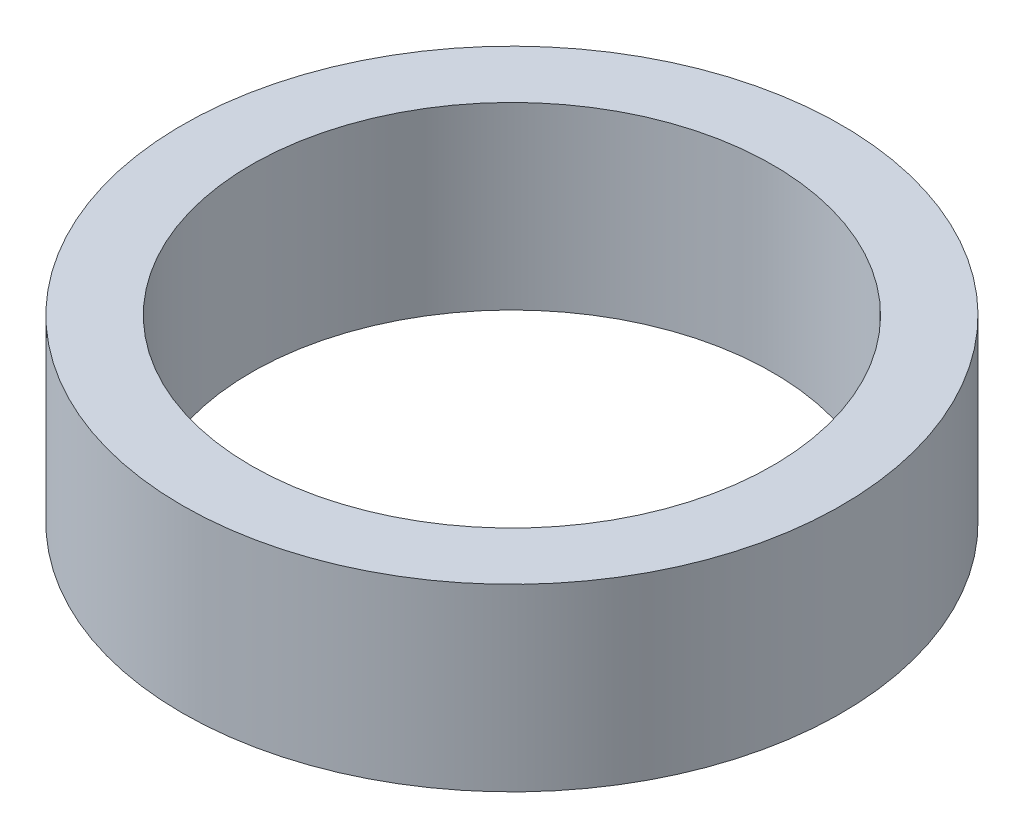
ISO-10303-21;
HEADER;
FILE_DESCRIPTION(('STEP AP214'),'2;1');
FILE_NAME('part.step','',(''),(''),'','','');
FILE_SCHEMA(('AUTOMOTIVE_DESIGN { 1 0 10303 214 1 1 1 1 }'));
ENDSEC;
DATA;
#1=APPLICATION_CONTEXT('core data for automotive mechanical design processes');
#2=APPLICATION_PROTOCOL_DEFINITION('international standard','automotive_design',2000,#1);
#3=PRODUCT_CONTEXT('',#1,'mechanical');
#4=PRODUCT('Part','Part','',(#3));
#5=PRODUCT_RELATED_PRODUCT_CATEGORY('part','',(#4));
#6=PRODUCT_DEFINITION_FORMATION('','',#4);
#7=PRODUCT_DEFINITION_CONTEXT('part definition',#1,'design');
#8=PRODUCT_DEFINITION('design','',#6,#7);
#9=PRODUCT_DEFINITION_SHAPE('','',#8);
#10=(LENGTH_UNIT() NAMED_UNIT(*) SI_UNIT(.MILLI.,.METRE.));
#11=(NAMED_UNIT(*) PLANE_ANGLE_UNIT() SI_UNIT($,.RADIAN.));
#12=(NAMED_UNIT(*) SI_UNIT($,.STERADIAN.) SOLID_ANGLE_UNIT());
#13=UNCERTAINTY_MEASURE_WITH_UNIT(LENGTH_MEASURE(1.E-05),#10,'distance_accuracy_value','');
#14=(GEOMETRIC_REPRESENTATION_CONTEXT(3) GLOBAL_UNCERTAINTY_ASSIGNED_CONTEXT((#13)) GLOBAL_UNIT_ASSIGNED_CONTEXT((#10,
#11,#12)) REPRESENTATION_CONTEXT('',''));
#15=CARTESIAN_POINT('',(0.,0.,0.));
#16=DIRECTION('',(0.,0.,1.));
#17=DIRECTION('',(1.,0.,0.));
#18=AXIS2_PLACEMENT_3D('',#15,#16,#17);
#19=CARTESIAN_POINT('',(-10.0999386023771,3.,-4.89887794912905));
#20=DIRECTION('',(0.,1.,0.));
#21=DIRECTION('',(0.,0.,1.));
#22=AXIS2_PLACEMENT_3D('',#19,#20,#21);
#23=PLANE('',#22);
#24=CARTESIAN_POINT('',(-10.0999386023771,3.,-4.89887794912905));
#25=DIRECTION('',(0.,1.,0.));
#26=DIRECTION('',(0.,0.,1.));
#27=AXIS2_PLACEMENT_3D('',#24,#25,#26);
#28=CIRCLE('',#27,5.5);
#29=CARTESIAN_POINT('',(-10.0999386023771,3.,0.601122050870947));
#30=VERTEX_POINT('',#29);
#31=EDGE_CURVE('E10',#30,#30,#28,.T.);
#32=ORIENTED_EDGE('',*,*,#31,.T.);
#33=EDGE_LOOP('',(#32));
#34=FACE_BOUND('',#33,.T.);
#35=CARTESIAN_POINT('',(-10.0999386023771,3.,-4.89887794912905));
#36=DIRECTION('',(0.,1.,0.));
#37=DIRECTION('',(0.,0.,1.));
#38=AXIS2_PLACEMENT_3D('',#35,#36,#37);
#39=CIRCLE('',#38,4.35);
#40=CARTESIAN_POINT('',(-10.0999386023771,3.,-0.548877949129053));
#41=VERTEX_POINT('',#40);
#42=EDGE_CURVE('E50',#41,#41,#39,.T.);
#43=ORIENTED_EDGE('',*,*,#42,.F.);
#44=EDGE_LOOP('',(#43));
#45=FACE_BOUND('',#44,.T.);
#46=ADVANCED_FACE('F37',(#34,#45),#23,.T.);
#47=CARTESIAN_POINT('',(-10.0999386023771,0.,-4.89887794912905));
#48=DIRECTION('',(0.,1.,0.));
#49=DIRECTION('',(0.,0.,1.));
#50=AXIS2_PLACEMENT_3D('',#47,#48,#49);
#51=PLANE('',#50);
#52=CARTESIAN_POINT('',(-10.0999386023771,0.,-4.89887794912905));
#53=DIRECTION('',(0.,1.,0.));
#54=DIRECTION('',(0.,0.,1.));
#55=AXIS2_PLACEMENT_3D('',#52,#53,#54);
#56=CIRCLE('',#55,5.5);
#57=CARTESIAN_POINT('',(-10.0999386023771,0.,0.601122050870947));
#58=VERTEX_POINT('',#57);
#59=EDGE_CURVE('E41',#58,#58,#56,.T.);
#60=ORIENTED_EDGE('',*,*,#59,.F.);
#61=EDGE_LOOP('',(#60));
#62=FACE_BOUND('',#61,.T.);
#63=CARTESIAN_POINT('',(-10.0999386023771,0.,-4.89887794912905));
#64=DIRECTION('',(0.,1.,0.));
#65=DIRECTION('',(0.,0.,1.));
#66=AXIS2_PLACEMENT_3D('',#63,#64,#65);
#67=CIRCLE('',#66,4.35);
#68=CARTESIAN_POINT('',(-10.0999386023771,0.,-0.548877949129053));
#69=VERTEX_POINT('',#68);
#70=EDGE_CURVE('E52',#69,#69,#67,.T.);
#71=ORIENTED_EDGE('',*,*,#70,.T.);
#72=EDGE_LOOP('',(#71));
#73=FACE_BOUND('',#72,.T.);
#74=ADVANCED_FACE('F64',(#62,#73),#51,.F.);
#75=CARTESIAN_POINT('',(-10.0999386023771,3.,-4.89887794912905));
#76=DIRECTION('',(0.,-1.,0.));
#77=DIRECTION('',(0.,0.,-1.));
#78=AXIS2_PLACEMENT_3D('',#75,#76,#77);
#79=CYLINDRICAL_SURFACE('',#78,5.5);
#80=ORIENTED_EDGE('',*,*,#31,.F.);
#81=EDGE_LOOP('',(#80));
#82=FACE_BOUND('',#81,.T.);
#83=ORIENTED_EDGE('',*,*,#59,.T.);
#84=EDGE_LOOP('',(#83));
#85=FACE_BOUND('',#84,.T.);
#86=ADVANCED_FACE('F39',(#82,#85),#79,.T.);
#87=CARTESIAN_POINT('',(-10.0999386023771,3.,-4.89887794912905));
#88=DIRECTION('',(0.,-1.,0.));
#89=DIRECTION('',(0.,0.,-1.));
#90=AXIS2_PLACEMENT_3D('',#87,#88,#89);
#91=CYLINDRICAL_SURFACE('',#90,4.35);
#92=ORIENTED_EDGE('',*,*,#42,.T.);
#93=EDGE_LOOP('',(#92));
#94=FACE_BOUND('',#93,.T.);
#95=ORIENTED_EDGE('',*,*,#70,.F.);
#96=EDGE_LOOP('',(#95));
#97=FACE_BOUND('',#96,.T.);
#98=ADVANCED_FACE('F60',(#94,#97),#91,.F.);
#99=CLOSED_SHELL('',(#46,#74,#86,#98));
#100=MANIFOLD_SOLID_BREP('B2',#99);
#101=ADVANCED_BREP_SHAPE_REPRESENTATION('',(#18,#100),#14);
#102=SHAPE_DEFINITION_REPRESENTATION(#9,#101);
ENDSEC;
END-ISO-10303-21;
